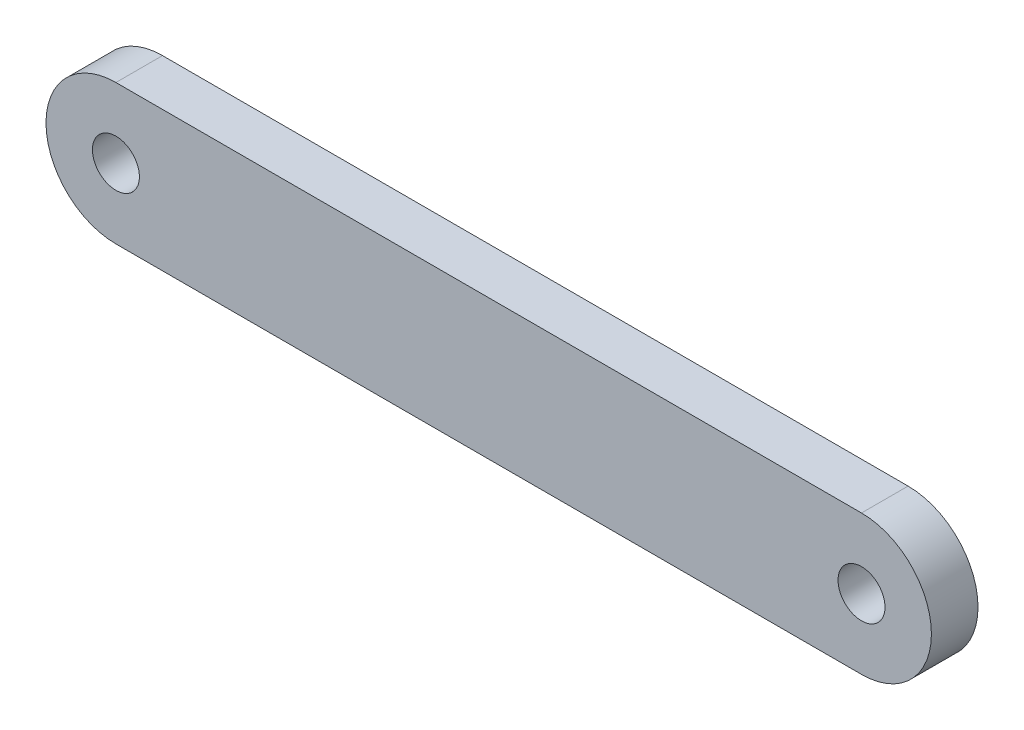
ISO-10303-21;
HEADER;
FILE_DESCRIPTION(('STEP AP214'),'2;1');
FILE_NAME('part.step','',(''),(''),'','','');
FILE_SCHEMA(('AUTOMOTIVE_DESIGN { 1 0 10303 214 1 1 1 1 }'));
ENDSEC;
DATA;
#1=APPLICATION_CONTEXT('core data for automotive mechanical design processes');
#2=APPLICATION_PROTOCOL_DEFINITION('international standard','automotive_design',2000,#1);
#3=PRODUCT_CONTEXT('',#1,'mechanical');
#4=PRODUCT('Part','Part','',(#3));
#5=PRODUCT_RELATED_PRODUCT_CATEGORY('part','',(#4));
#6=PRODUCT_DEFINITION_FORMATION('','',#4);
#7=PRODUCT_DEFINITION_CONTEXT('part definition',#1,'design');
#8=PRODUCT_DEFINITION('design','',#6,#7);
#9=PRODUCT_DEFINITION_SHAPE('','',#8);
#10=(LENGTH_UNIT() NAMED_UNIT(*) SI_UNIT(.MILLI.,.METRE.));
#11=(NAMED_UNIT(*) PLANE_ANGLE_UNIT() SI_UNIT($,.RADIAN.));
#12=(NAMED_UNIT(*) SI_UNIT($,.STERADIAN.) SOLID_ANGLE_UNIT());
#13=UNCERTAINTY_MEASURE_WITH_UNIT(LENGTH_MEASURE(1.E-05),#10,'distance_accuracy_value','');
#14=(GEOMETRIC_REPRESENTATION_CONTEXT(3) GLOBAL_UNCERTAINTY_ASSIGNED_CONTEXT((#13)) GLOBAL_UNIT_ASSIGNED_CONTEXT((#10,
#11,#12)) REPRESENTATION_CONTEXT('',''));
#15=CARTESIAN_POINT('',(0.,0.,0.));
#16=DIRECTION('',(0.,0.,1.));
#17=DIRECTION('',(1.,0.,0.));
#18=AXIS2_PLACEMENT_3D('',#15,#16,#17);
#19=CARTESIAN_POINT('',(-25.4,0.,1.5875));
#20=DIRECTION('',(0.,0.,-1.));
#21=DIRECTION('',(-1.,0.,0.));
#22=AXIS2_PLACEMENT_3D('',#19,#20,#21);
#23=CYLINDRICAL_SURFACE('',#22,4.7625);
#24=CARTESIAN_POINT('',(-25.4,0.,-1.5875));
#25=DIRECTION('',(0.,0.,1.));
#26=DIRECTION('',(1.,0.,0.));
#27=AXIS2_PLACEMENT_3D('',#24,#25,#26);
#28=CIRCLE('',#27,4.7625);
#29=CARTESIAN_POINT('',(-25.4,4.7625,-1.5875));
#30=VERTEX_POINT('',#29);
#31=CARTESIAN_POINT('',(-25.4,-4.7625,-1.5875));
#32=VERTEX_POINT('',#31);
#33=EDGE_CURVE('E103',#30,#32,#28,.T.);
#34=ORIENTED_EDGE('',*,*,#33,.T.);
#35=DIRECTION('',(0.,0.,-1.));
#36=VECTOR('',#35,1.);
#37=CARTESIAN_POINT('',(-25.4,-4.7625,1.5875));
#38=LINE('',#37,#36);
#39=CARTESIAN_POINT('',(-25.4,-4.7625,1.5875));
#40=VERTEX_POINT('',#39);
#41=EDGE_CURVE('E11',#40,#32,#38,.T.);
#42=ORIENTED_EDGE('',*,*,#41,.F.);
#43=CARTESIAN_POINT('',(-25.4,0.,1.5875));
#44=DIRECTION('',(0.,0.,1.));
#45=DIRECTION('',(1.,0.,0.));
#46=AXIS2_PLACEMENT_3D('',#43,#44,#45);
#47=CIRCLE('',#46,4.7625);
#48=CARTESIAN_POINT('',(-25.4,4.7625,1.5875));
#49=VERTEX_POINT('',#48);
#50=EDGE_CURVE('E91',#49,#40,#47,.T.);
#51=ORIENTED_EDGE('',*,*,#50,.F.);
#52=DIRECTION('',(0.,0.,-1.));
#53=VECTOR('',#52,1.);
#54=CARTESIAN_POINT('',(-25.4,4.7625,1.5875));
#55=LINE('',#54,#53);
#56=EDGE_CURVE('E99',#49,#30,#55,.T.);
#57=ORIENTED_EDGE('',*,*,#56,.T.);
#58=EDGE_LOOP('',(#34,#42,#51,#57));
#59=FACE_BOUND('',#58,.T.);
#60=ADVANCED_FACE('F40',(#59),#23,.T.);
#61=CARTESIAN_POINT('',(-25.4,-4.7625,1.5875));
#62=DIRECTION('',(0.,1.,0.));
#63=DIRECTION('',(0.,0.,1.));
#64=AXIS2_PLACEMENT_3D('',#61,#62,#63);
#65=PLANE('',#64);
#66=DIRECTION('',(1.,0.,0.));
#67=VECTOR('',#66,1.);
#68=CARTESIAN_POINT('',(-25.4,-4.7625,-1.5875));
#69=LINE('',#68,#67);
#70=CARTESIAN_POINT('',(25.4,-4.7625,-1.5875));
#71=VERTEX_POINT('',#70);
#72=EDGE_CURVE('E95',#32,#71,#69,.T.);
#73=ORIENTED_EDGE('',*,*,#72,.T.);
#74=DIRECTION('',(0.,0.,-1.));
#75=VECTOR('',#74,1.);
#76=CARTESIAN_POINT('',(25.4,-4.7625,1.5875));
#77=LINE('',#76,#75);
#78=CARTESIAN_POINT('',(25.4,-4.7625,1.5875));
#79=VERTEX_POINT('',#78);
#80=EDGE_CURVE('E48',#79,#71,#77,.T.);
#81=ORIENTED_EDGE('',*,*,#80,.F.);
#82=DIRECTION('',(1.,0.,0.));
#83=VECTOR('',#82,1.);
#84=CARTESIAN_POINT('',(-25.4,-4.7625,1.5875));
#85=LINE('',#84,#83);
#86=EDGE_CURVE('E86',#40,#79,#85,.T.);
#87=ORIENTED_EDGE('',*,*,#86,.F.);
#88=ORIENTED_EDGE('',*,*,#41,.T.);
#89=EDGE_LOOP('',(#73,#81,#87,#88));
#90=FACE_BOUND('',#89,.T.);
#91=ADVANCED_FACE('F94',(#90),#65,.F.);
#92=CARTESIAN_POINT('',(25.4,0.,1.5875));
#93=DIRECTION('',(0.,0.,-1.));
#94=DIRECTION('',(-1.,0.,0.));
#95=AXIS2_PLACEMENT_3D('',#92,#93,#94);
#96=CYLINDRICAL_SURFACE('',#95,4.7625);
#97=CARTESIAN_POINT('',(25.4,0.,-1.5875));
#98=DIRECTION('',(0.,0.,1.));
#99=DIRECTION('',(1.,0.,0.));
#100=AXIS2_PLACEMENT_3D('',#97,#98,#99);
#101=CIRCLE('',#100,4.7625);
#102=CARTESIAN_POINT('',(25.4,4.7625,-1.5875));
#103=VERTEX_POINT('',#102);
#104=EDGE_CURVE('E73',#71,#103,#101,.T.);
#105=ORIENTED_EDGE('',*,*,#104,.T.);
#106=DIRECTION('',(0.,0.,-1.));
#107=VECTOR('',#106,1.);
#108=CARTESIAN_POINT('',(25.4,4.7625,1.5875));
#109=LINE('',#108,#107);
#110=CARTESIAN_POINT('',(25.4,4.7625,1.5875));
#111=VERTEX_POINT('',#110);
#112=EDGE_CURVE('E96',#111,#103,#109,.T.);
#113=ORIENTED_EDGE('',*,*,#112,.F.);
#114=CARTESIAN_POINT('',(25.4,0.,1.5875));
#115=DIRECTION('',(0.,0.,1.));
#116=DIRECTION('',(1.,0.,0.));
#117=AXIS2_PLACEMENT_3D('',#114,#115,#116);
#118=CIRCLE('',#117,4.7625);
#119=EDGE_CURVE('E89',#79,#111,#118,.T.);
#120=ORIENTED_EDGE('',*,*,#119,.F.);
#121=ORIENTED_EDGE('',*,*,#80,.T.);
#122=EDGE_LOOP('',(#105,#113,#120,#121));
#123=FACE_BOUND('',#122,.T.);
#124=ADVANCED_FACE('F97',(#123),#96,.T.);
#125=CARTESIAN_POINT('',(-25.4,4.7625,1.5875));
#126=DIRECTION('',(0.,-1.,0.));
#127=DIRECTION('',(0.,0.,-1.));
#128=AXIS2_PLACEMENT_3D('',#125,#126,#127);
#129=PLANE('',#128);
#130=DIRECTION('',(-1.,0.,0.));
#131=VECTOR('',#130,1.);
#132=CARTESIAN_POINT('',(-25.4,4.7625,-1.5875));
#133=LINE('',#132,#131);
#134=EDGE_CURVE('E79',#103,#30,#133,.T.);
#135=ORIENTED_EDGE('',*,*,#134,.T.);
#136=ORIENTED_EDGE('',*,*,#56,.F.);
#137=DIRECTION('',(-1.,0.,0.));
#138=VECTOR('',#137,1.);
#139=CARTESIAN_POINT('',(-25.4,4.7625,1.5875));
#140=LINE('',#139,#138);
#141=EDGE_CURVE('E56',#111,#49,#140,.T.);
#142=ORIENTED_EDGE('',*,*,#141,.F.);
#143=ORIENTED_EDGE('',*,*,#112,.T.);
#144=EDGE_LOOP('',(#135,#136,#142,#143));
#145=FACE_BOUND('',#144,.T.);
#146=ADVANCED_FACE('F111',(#145),#129,.F.);
#147=CARTESIAN_POINT('',(-25.4,0.,1.5875));
#148=DIRECTION('',(0.,0.,1.));
#149=DIRECTION('',(1.,0.,0.));
#150=AXIS2_PLACEMENT_3D('',#147,#148,#149);
#151=PLANE('',#150);
#152=CARTESIAN_POINT('',(-25.4,0.,1.5875));
#153=DIRECTION('',(0.,0.,1.));
#154=DIRECTION('',(1.,0.,0.));
#155=AXIS2_PLACEMENT_3D('',#152,#153,#154);
#156=CIRCLE('',#155,1.6002);
#157=CARTESIAN_POINT('',(-23.7998,0.,1.5875));
#158=VERTEX_POINT('',#157);
#159=EDGE_CURVE('E125',#158,#158,#156,.T.);
#160=ORIENTED_EDGE('',*,*,#159,.F.);
#161=EDGE_LOOP('',(#160));
#162=FACE_BOUND('',#161,.T.);
#163=CARTESIAN_POINT('',(25.4,0.,1.5875));
#164=DIRECTION('',(0.,0.,1.));
#165=DIRECTION('',(1.,0.,0.));
#166=AXIS2_PLACEMENT_3D('',#163,#164,#165);
#167=CIRCLE('',#166,1.6002);
#168=CARTESIAN_POINT('',(27.0002,0.,1.5875));
#169=VERTEX_POINT('',#168);
#170=EDGE_CURVE('E119',#169,#169,#167,.T.);
#171=ORIENTED_EDGE('',*,*,#170,.F.);
#172=EDGE_LOOP('',(#171));
#173=FACE_BOUND('',#172,.T.);
#174=ORIENTED_EDGE('',*,*,#50,.T.);
#175=ORIENTED_EDGE('',*,*,#86,.T.);
#176=ORIENTED_EDGE('',*,*,#119,.T.);
#177=ORIENTED_EDGE('',*,*,#141,.T.);
#178=EDGE_LOOP('',(#174,#175,#176,#177));
#179=FACE_BOUND('',#178,.T.);
#180=ADVANCED_FACE('F87',(#162,#173,#179),#151,.T.);
#181=CARTESIAN_POINT('',(-25.4,0.,-1.5875));
#182=DIRECTION('',(0.,0.,1.));
#183=DIRECTION('',(1.,0.,0.));
#184=AXIS2_PLACEMENT_3D('',#181,#182,#183);
#185=PLANE('',#184);
#186=CARTESIAN_POINT('',(-25.4,0.,-1.5875));
#187=DIRECTION('',(0.,0.,1.));
#188=DIRECTION('',(1.,0.,0.));
#189=AXIS2_PLACEMENT_3D('',#186,#187,#188);
#190=CIRCLE('',#189,1.6002);
#191=CARTESIAN_POINT('',(-23.7998,0.,-1.5875));
#192=VERTEX_POINT('',#191);
#193=EDGE_CURVE('E122',#192,#192,#190,.T.);
#194=ORIENTED_EDGE('',*,*,#193,.T.);
#195=EDGE_LOOP('',(#194));
#196=FACE_BOUND('',#195,.T.);
#197=CARTESIAN_POINT('',(25.4,0.,-1.5875));
#198=DIRECTION('',(0.,0.,1.));
#199=DIRECTION('',(1.,0.,0.));
#200=AXIS2_PLACEMENT_3D('',#197,#198,#199);
#201=CIRCLE('',#200,1.6002);
#202=CARTESIAN_POINT('',(27.0002,0.,-1.5875));
#203=VERTEX_POINT('',#202);
#204=EDGE_CURVE('E106',#203,#203,#201,.T.);
#205=ORIENTED_EDGE('',*,*,#204,.T.);
#206=EDGE_LOOP('',(#205));
#207=FACE_BOUND('',#206,.T.);
#208=ORIENTED_EDGE('',*,*,#33,.F.);
#209=ORIENTED_EDGE('',*,*,#134,.F.);
#210=ORIENTED_EDGE('',*,*,#104,.F.);
#211=ORIENTED_EDGE('',*,*,#72,.F.);
#212=EDGE_LOOP('',(#208,#209,#210,#211));
#213=FACE_BOUND('',#212,.T.);
#214=ADVANCED_FACE('F114',(#196,#207,#213),#185,.F.);
#215=CARTESIAN_POINT('',(25.4,0.,1.5875));
#216=DIRECTION('',(0.,0.,1.));
#217=DIRECTION('',(1.,0.,0.));
#218=AXIS2_PLACEMENT_3D('',#215,#216,#217);
#219=CYLINDRICAL_SURFACE('',#218,1.6002);
#220=ORIENTED_EDGE('',*,*,#204,.F.);
#221=EDGE_LOOP('',(#220));
#222=FACE_BOUND('',#221,.T.);
#223=ORIENTED_EDGE('',*,*,#170,.T.);
#224=EDGE_LOOP('',(#223));
#225=FACE_BOUND('',#224,.T.);
#226=ADVANCED_FACE('F136',(#222,#225),#219,.F.);
#227=CARTESIAN_POINT('',(-25.4,0.,1.5875));
#228=DIRECTION('',(0.,0.,1.));
#229=DIRECTION('',(1.,0.,0.));
#230=AXIS2_PLACEMENT_3D('',#227,#228,#229);
#231=CYLINDRICAL_SURFACE('',#230,1.6002);
#232=ORIENTED_EDGE('',*,*,#193,.F.);
#233=EDGE_LOOP('',(#232));
#234=FACE_BOUND('',#233,.T.);
#235=ORIENTED_EDGE('',*,*,#159,.T.);
#236=EDGE_LOOP('',(#235));
#237=FACE_BOUND('',#236,.T.);
#238=ADVANCED_FACE('F129',(#234,#237),#231,.F.);
#239=CLOSED_SHELL('',(#60,#91,#124,#146,#180,#214,#226,#238));
#240=MANIFOLD_SOLID_BREP('B2',#239);
#241=ADVANCED_BREP_SHAPE_REPRESENTATION('',(#18,#240),#14);
#242=SHAPE_DEFINITION_REPRESENTATION(#9,#241);
ENDSEC;
END-ISO-10303-21;
